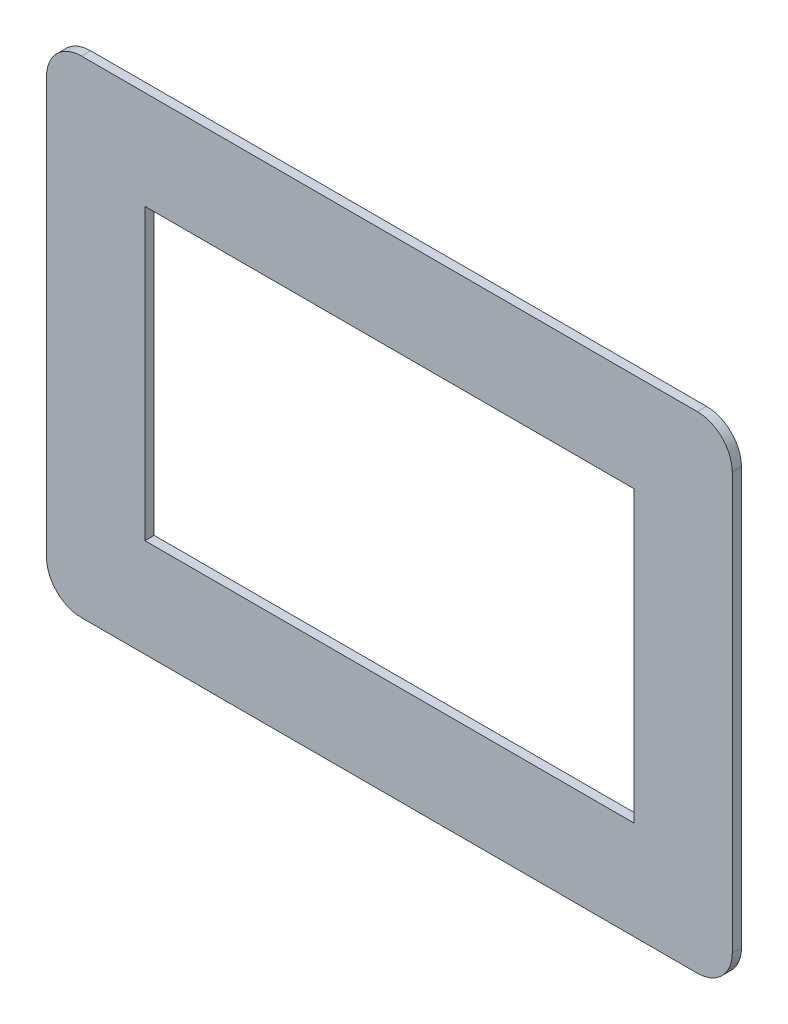
ISO-10303-21;
HEADER;
FILE_DESCRIPTION(('STEP AP214'),'2;1');
FILE_NAME('part.step','',(''),(''),'','','');
FILE_SCHEMA(('AUTOMOTIVE_DESIGN { 1 0 10303 214 1 1 1 1 }'));
ENDSEC;
DATA;
#1=APPLICATION_CONTEXT('core data for automotive mechanical design processes');
#2=APPLICATION_PROTOCOL_DEFINITION('international standard','automotive_design',2000,#1);
#3=PRODUCT_CONTEXT('',#1,'mechanical');
#4=PRODUCT('Part','Part','',(#3));
#5=PRODUCT_RELATED_PRODUCT_CATEGORY('part','',(#4));
#6=PRODUCT_DEFINITION_FORMATION('','',#4);
#7=PRODUCT_DEFINITION_CONTEXT('part definition',#1,'design');
#8=PRODUCT_DEFINITION('design','',#6,#7);
#9=PRODUCT_DEFINITION_SHAPE('','',#8);
#10=(LENGTH_UNIT() NAMED_UNIT(*) SI_UNIT(.MILLI.,.METRE.));
#11=(NAMED_UNIT(*) PLANE_ANGLE_UNIT() SI_UNIT($,.RADIAN.));
#12=(NAMED_UNIT(*) SI_UNIT($,.STERADIAN.) SOLID_ANGLE_UNIT());
#13=UNCERTAINTY_MEASURE_WITH_UNIT(LENGTH_MEASURE(1.E-05),#10,'distance_accuracy_value','');
#14=(GEOMETRIC_REPRESENTATION_CONTEXT(3) GLOBAL_UNCERTAINTY_ASSIGNED_CONTEXT((#13)) GLOBAL_UNIT_ASSIGNED_CONTEXT((#10,
#11,#12)) REPRESENTATION_CONTEXT('',''));
#15=CARTESIAN_POINT('',(0.,0.,0.));
#16=DIRECTION('',(0.,0.,1.));
#17=DIRECTION('',(1.,0.,0.));
#18=AXIS2_PLACEMENT_3D('',#15,#16,#17);
#19=CARTESIAN_POINT('',(99.87625,65.6,0.));
#20=DIRECTION('',(0.,0.,-1.));
#21=DIRECTION('',(-1.,0.,0.));
#22=AXIS2_PLACEMENT_3D('',#19,#20,#21);
#23=PLANE('',#22);
#24=CARTESIAN_POINT('',(99.87625,65.6,0.));
#25=DIRECTION('',(0.,0.,1.));
#26=DIRECTION('',(-1.,0.,0.));
#27=AXIS2_PLACEMENT_3D('',#24,#25,#26);
#28=CIRCLE('',#27,11.);
#29=CARTESIAN_POINT('',(110.87625,65.6,0.));
#30=VERTEX_POINT('',#29);
#31=CARTESIAN_POINT('',(99.87625,76.6,0.));
#32=VERTEX_POINT('',#31);
#33=EDGE_CURVE('E374',#30,#32,#28,.T.);
#34=ORIENTED_EDGE('',*,*,#33,.F.);
#35=DIRECTION('',(0.,1.,0.));
#36=VECTOR('',#35,1.);
#37=CARTESIAN_POINT('',(110.87625,65.6,0.));
#38=LINE('',#37,#36);
#39=CARTESIAN_POINT('',(110.87625,-65.6,0.));
#40=VERTEX_POINT('',#39);
#41=EDGE_CURVE('E379',#40,#30,#38,.T.);
#42=ORIENTED_EDGE('',*,*,#41,.F.);
#43=CARTESIAN_POINT('',(99.87625,-65.6,0.));
#44=DIRECTION('',(0.,0.,1.));
#45=DIRECTION('',(-1.,0.,0.));
#46=AXIS2_PLACEMENT_3D('',#43,#44,#45);
#47=CIRCLE('',#46,11.);
#48=CARTESIAN_POINT('',(99.87625,-76.6,0.));
#49=VERTEX_POINT('',#48);
#50=EDGE_CURVE('E406',#49,#40,#47,.T.);
#51=ORIENTED_EDGE('',*,*,#50,.F.);
#52=DIRECTION('',(1.,0.,0.));
#53=VECTOR('',#52,1.);
#54=CARTESIAN_POINT('',(99.87625,-76.6,0.));
#55=LINE('',#54,#53);
#56=CARTESIAN_POINT('',(-94.12375,-76.6000000000001,0.));
#57=VERTEX_POINT('',#56);
#58=EDGE_CURVE('E404',#57,#49,#55,.T.);
#59=ORIENTED_EDGE('',*,*,#58,.F.);
#60=CARTESIAN_POINT('',(-94.12375,-65.6000000000001,0.));
#61=DIRECTION('',(0.,0.,1.));
#62=DIRECTION('',(-1.,0.,0.));
#63=AXIS2_PLACEMENT_3D('',#60,#61,#62);
#64=CIRCLE('',#63,11.);
#65=CARTESIAN_POINT('',(-105.12375,-65.6000000000001,0.));
#66=VERTEX_POINT('',#65);
#67=EDGE_CURVE('E402',#66,#57,#64,.T.);
#68=ORIENTED_EDGE('',*,*,#67,.F.);
#69=DIRECTION('',(0.,-1.,0.));
#70=VECTOR('',#69,1.);
#71=CARTESIAN_POINT('',(-105.12375,65.6000000000001,0.));
#72=LINE('',#71,#70);
#73=CARTESIAN_POINT('',(-105.12375,65.6000000000001,0.));
#74=VERTEX_POINT('',#73);
#75=EDGE_CURVE('E400',#74,#66,#72,.T.);
#76=ORIENTED_EDGE('',*,*,#75,.F.);
#77=CARTESIAN_POINT('',(-94.12375,65.6000000000001,0.));
#78=DIRECTION('',(0.,0.,1.));
#79=DIRECTION('',(1.,0.,0.));
#80=AXIS2_PLACEMENT_3D('',#77,#78,#79);
#81=CIRCLE('',#80,11.);
#82=CARTESIAN_POINT('',(-94.12375,76.6,0.));
#83=VERTEX_POINT('',#82);
#84=EDGE_CURVE('E398',#83,#74,#81,.T.);
#85=ORIENTED_EDGE('',*,*,#84,.F.);
#86=DIRECTION('',(-1.,0.,0.));
#87=VECTOR('',#86,1.);
#88=CARTESIAN_POINT('',(99.87625,76.6,0.));
#89=LINE('',#88,#87);
#90=EDGE_CURVE('E396',#32,#83,#89,.T.);
#91=ORIENTED_EDGE('',*,*,#90,.F.);
#92=EDGE_LOOP('',(#34,#42,#51,#59,#68,#76,#85,#91));
#93=FACE_BOUND('',#92,.T.);
#94=DIRECTION('',(0.,1.,0.));
#95=VECTOR('',#94,1.);
#96=CARTESIAN_POINT('',(109.87625,-65.6,0.));
#97=LINE('',#96,#95);
#98=CARTESIAN_POINT('',(109.87625,-65.6,0.));
#99=VERTEX_POINT('',#98);
#100=CARTESIAN_POINT('',(109.87625,65.6,0.));
#101=VERTEX_POINT('',#100);
#102=EDGE_CURVE('E292',#99,#101,#97,.T.);
#103=ORIENTED_EDGE('',*,*,#102,.T.);
#104=CARTESIAN_POINT('',(99.87625,65.6,0.));
#105=DIRECTION('',(0.,0.,1.));
#106=DIRECTION('',(1.,0.,0.));
#107=AXIS2_PLACEMENT_3D('',#104,#105,#106);
#108=CIRCLE('',#107,9.99999999999999);
#109=CARTESIAN_POINT('',(99.87625,75.6,0.));
#110=VERTEX_POINT('',#109);
#111=EDGE_CURVE('E48',#101,#110,#108,.T.);
#112=ORIENTED_EDGE('',*,*,#111,.T.);
#113=DIRECTION('',(-1.,0.,0.));
#114=VECTOR('',#113,1.);
#115=CARTESIAN_POINT('',(99.87625,75.6,0.));
#116=LINE('',#115,#114);
#117=CARTESIAN_POINT('',(-94.12375,75.6,0.));
#118=VERTEX_POINT('',#117);
#119=EDGE_CURVE('E308',#110,#118,#116,.T.);
#120=ORIENTED_EDGE('',*,*,#119,.T.);
#121=CARTESIAN_POINT('',(-94.12375,65.6000000000001,0.));
#122=DIRECTION('',(0.,0.,1.));
#123=DIRECTION('',(1.,0.,0.));
#124=AXIS2_PLACEMENT_3D('',#121,#122,#123);
#125=CIRCLE('',#124,9.99999999999995);
#126=CARTESIAN_POINT('',(-104.12375,65.6000000000001,0.));
#127=VERTEX_POINT('',#126);
#128=EDGE_CURVE('E311',#118,#127,#125,.T.);
#129=ORIENTED_EDGE('',*,*,#128,.T.);
#130=DIRECTION('',(0.,-1.,0.));
#131=VECTOR('',#130,1.);
#132=CARTESIAN_POINT('',(-104.12375,65.6000000000001,0.));
#133=LINE('',#132,#131);
#134=CARTESIAN_POINT('',(-104.12375,-65.6000000000001,0.));
#135=VERTEX_POINT('',#134);
#136=EDGE_CURVE('E314',#127,#135,#133,.T.);
#137=ORIENTED_EDGE('',*,*,#136,.T.);
#138=CARTESIAN_POINT('',(-94.12375,-65.6000000000001,0.));
#139=DIRECTION('',(0.,0.,1.));
#140=DIRECTION('',(1.,0.,0.));
#141=AXIS2_PLACEMENT_3D('',#138,#139,#140);
#142=CIRCLE('',#141,10.);
#143=CARTESIAN_POINT('',(-94.12375,-75.6000000000001,0.));
#144=VERTEX_POINT('',#143);
#145=EDGE_CURVE('E317',#135,#144,#142,.T.);
#146=ORIENTED_EDGE('',*,*,#145,.T.);
#147=DIRECTION('',(1.,0.,0.));
#148=VECTOR('',#147,1.);
#149=CARTESIAN_POINT('',(-94.12375,-75.6000000000001,0.));
#150=LINE('',#149,#148);
#151=CARTESIAN_POINT('',(99.87625,-75.6,0.));
#152=VERTEX_POINT('',#151);
#153=EDGE_CURVE('E320',#144,#152,#150,.T.);
#154=ORIENTED_EDGE('',*,*,#153,.T.);
#155=CARTESIAN_POINT('',(99.87625,-65.6,0.));
#156=DIRECTION('',(0.,0.,1.));
#157=DIRECTION('',(1.,0.,0.));
#158=AXIS2_PLACEMENT_3D('',#155,#156,#157);
#159=CIRCLE('',#158,9.99999999999999);
#160=EDGE_CURVE('E323',#152,#99,#159,.T.);
#161=ORIENTED_EDGE('',*,*,#160,.T.);
#162=EDGE_LOOP('',(#103,#112,#120,#129,#137,#146,#154,#161));
#163=FACE_BOUND('',#162,.T.);
#164=ADVANCED_FACE('F33',(#93,#163),#23,.T.);
#165=CARTESIAN_POINT('',(99.87625,65.6,2.9));
#166=DIRECTION('',(0.,0.,-1.));
#167=DIRECTION('',(-1.,0.,0.));
#168=AXIS2_PLACEMENT_3D('',#165,#166,#167);
#169=PLANE('',#168);
#170=CARTESIAN_POINT('',(99.87625,65.6,2.9));
#171=DIRECTION('',(0.,0.,1.));
#172=DIRECTION('',(-1.,0.,0.));
#173=AXIS2_PLACEMENT_3D('',#170,#171,#172);
#174=CIRCLE('',#173,11.);
#175=CARTESIAN_POINT('',(110.87625,65.6,2.9));
#176=VERTEX_POINT('',#175);
#177=CARTESIAN_POINT('',(99.87625,76.6,2.9));
#178=VERTEX_POINT('',#177);
#179=EDGE_CURVE('E375',#176,#178,#174,.T.);
#180=ORIENTED_EDGE('',*,*,#179,.T.);
#181=DIRECTION('',(-1.,0.,0.));
#182=VECTOR('',#181,1.);
#183=CARTESIAN_POINT('',(99.87625,76.6,2.9));
#184=LINE('',#183,#182);
#185=CARTESIAN_POINT('',(-94.12375,76.6,2.9));
#186=VERTEX_POINT('',#185);
#187=EDGE_CURVE('E378',#178,#186,#184,.T.);
#188=ORIENTED_EDGE('',*,*,#187,.T.);
#189=CARTESIAN_POINT('',(-94.12375,65.6000000000001,2.9));
#190=DIRECTION('',(0.,0.,1.));
#191=DIRECTION('',(1.,0.,0.));
#192=AXIS2_PLACEMENT_3D('',#189,#190,#191);
#193=CIRCLE('',#192,11.);
#194=CARTESIAN_POINT('',(-105.12375,65.6000000000001,2.9));
#195=VERTEX_POINT('',#194);
#196=EDGE_CURVE('E381',#186,#195,#193,.T.);
#197=ORIENTED_EDGE('',*,*,#196,.T.);
#198=DIRECTION('',(0.,-1.,0.));
#199=VECTOR('',#198,1.);
#200=CARTESIAN_POINT('',(-105.12375,65.6000000000001,2.9));
#201=LINE('',#200,#199);
#202=CARTESIAN_POINT('',(-105.12375,-65.6000000000001,2.9));
#203=VERTEX_POINT('',#202);
#204=EDGE_CURVE('E383',#195,#203,#201,.T.);
#205=ORIENTED_EDGE('',*,*,#204,.T.);
#206=CARTESIAN_POINT('',(-94.12375,-65.6000000000001,2.9));
#207=DIRECTION('',(0.,0.,1.));
#208=DIRECTION('',(-1.,0.,0.));
#209=AXIS2_PLACEMENT_3D('',#206,#207,#208);
#210=CIRCLE('',#209,11.);
#211=CARTESIAN_POINT('',(-94.12375,-76.6000000000001,2.9));
#212=VERTEX_POINT('',#211);
#213=EDGE_CURVE('E385',#203,#212,#210,.T.);
#214=ORIENTED_EDGE('',*,*,#213,.T.);
#215=DIRECTION('',(1.,0.,0.));
#216=VECTOR('',#215,1.);
#217=CARTESIAN_POINT('',(99.87625,-76.6,2.9));
#218=LINE('',#217,#216);
#219=CARTESIAN_POINT('',(99.87625,-76.6,2.9));
#220=VERTEX_POINT('',#219);
#221=EDGE_CURVE('E387',#212,#220,#218,.T.);
#222=ORIENTED_EDGE('',*,*,#221,.T.);
#223=CARTESIAN_POINT('',(99.87625,-65.6,2.9));
#224=DIRECTION('',(0.,0.,1.));
#225=DIRECTION('',(-1.,0.,0.));
#226=AXIS2_PLACEMENT_3D('',#223,#224,#225);
#227=CIRCLE('',#226,11.);
#228=CARTESIAN_POINT('',(110.87625,-65.6,2.9));
#229=VERTEX_POINT('',#228);
#230=EDGE_CURVE('E389',#220,#229,#227,.T.);
#231=ORIENTED_EDGE('',*,*,#230,.T.);
#232=DIRECTION('',(0.,1.,0.));
#233=VECTOR('',#232,1.);
#234=CARTESIAN_POINT('',(110.87625,65.6,2.9));
#235=LINE('',#234,#233);
#236=EDGE_CURVE('E391',#229,#176,#235,.T.);
#237=ORIENTED_EDGE('',*,*,#236,.T.);
#238=EDGE_LOOP('',(#180,#188,#197,#205,#214,#222,#231,#237));
#239=FACE_BOUND('',#238,.T.);
#240=DIRECTION('',(0.,1.,0.));
#241=VECTOR('',#240,1.);
#242=CARTESIAN_POINT('',(79.87625,45.6,2.9));
#243=LINE('',#242,#241);
#244=CARTESIAN_POINT('',(79.87625,-45.6,2.9));
#245=VERTEX_POINT('',#244);
#246=CARTESIAN_POINT('',(79.87625,45.6,2.9));
#247=VERTEX_POINT('',#246);
#248=EDGE_CURVE('E344',#245,#247,#243,.T.);
#249=ORIENTED_EDGE('',*,*,#248,.F.);
#250=DIRECTION('',(1.,0.,0.));
#251=VECTOR('',#250,1.);
#252=CARTESIAN_POINT('',(79.87625,-45.6,2.9));
#253=LINE('',#252,#251);
#254=CARTESIAN_POINT('',(-74.12375,-45.6,2.9));
#255=VERTEX_POINT('',#254);
#256=EDGE_CURVE('E352',#255,#245,#253,.T.);
#257=ORIENTED_EDGE('',*,*,#256,.F.);
#258=DIRECTION('',(0.,-1.,0.));
#259=VECTOR('',#258,1.);
#260=CARTESIAN_POINT('',(-74.12375,45.6,2.9));
#261=LINE('',#260,#259);
#262=CARTESIAN_POINT('',(-74.12375,45.6,2.9));
#263=VERTEX_POINT('',#262);
#264=EDGE_CURVE('E349',#263,#255,#261,.T.);
#265=ORIENTED_EDGE('',*,*,#264,.F.);
#266=DIRECTION('',(-1.,0.,0.));
#267=VECTOR('',#266,1.);
#268=CARTESIAN_POINT('',(79.87625,45.6,2.9));
#269=LINE('',#268,#267);
#270=EDGE_CURVE('E346',#247,#263,#269,.T.);
#271=ORIENTED_EDGE('',*,*,#270,.F.);
#272=EDGE_LOOP('',(#249,#257,#265,#271));
#273=FACE_BOUND('',#272,.T.);
#274=ADVANCED_FACE('F449',(#239,#273),#169,.F.);
#275=CARTESIAN_POINT('',(99.87625,65.6,0.));
#276=DIRECTION('',(0.,0.,1.));
#277=DIRECTION('',(1.,0.,0.));
#278=AXIS2_PLACEMENT_3D('',#275,#276,#277);
#279=CIRCLE('',#278,7.99999999999999);
#280=CARTESIAN_POINT('',(107.87625,65.6,0.));
#281=VERTEX_POINT('',#280);
#282=CARTESIAN_POINT('',(99.87625,73.6,0.));
#283=VERTEX_POINT('',#282);
#284=EDGE_CURVE('E236',#281,#283,#279,.T.);
#285=ORIENTED_EDGE('',*,*,#284,.F.);
#286=DIRECTION('',(0.,1.,0.));
#287=VECTOR('',#286,1.);
#288=CARTESIAN_POINT('',(107.87625,-65.6,0.));
#289=LINE('',#288,#287);
#290=CARTESIAN_POINT('',(107.87625,-65.6,0.));
#291=VERTEX_POINT('',#290);
#292=EDGE_CURVE('E230',#291,#281,#289,.T.);
#293=ORIENTED_EDGE('',*,*,#292,.F.);
#294=CARTESIAN_POINT('',(99.87625,-65.6,0.));
#295=DIRECTION('',(0.,0.,1.));
#296=DIRECTION('',(1.,0.,0.));
#297=AXIS2_PLACEMENT_3D('',#294,#295,#296);
#298=CIRCLE('',#297,7.99999999999999);
#299=CARTESIAN_POINT('',(99.87625,-73.6,0.));
#300=VERTEX_POINT('',#299);
#301=EDGE_CURVE('E56',#300,#291,#298,.T.);
#302=ORIENTED_EDGE('',*,*,#301,.F.);
#303=DIRECTION('',(1.,0.,0.));
#304=VECTOR('',#303,1.);
#305=CARTESIAN_POINT('',(-94.12375,-73.6000000000001,0.));
#306=LINE('',#305,#304);
#307=CARTESIAN_POINT('',(-94.12375,-73.6000000000001,0.));
#308=VERTEX_POINT('',#307);
#309=EDGE_CURVE('E270',#308,#300,#306,.T.);
#310=ORIENTED_EDGE('',*,*,#309,.F.);
#311=CARTESIAN_POINT('',(-94.12375,-65.6000000000001,0.));
#312=DIRECTION('',(0.,0.,1.));
#313=DIRECTION('',(1.,0.,0.));
#314=AXIS2_PLACEMENT_3D('',#311,#312,#313);
#315=CIRCLE('',#314,8.);
#316=CARTESIAN_POINT('',(-102.12375,-65.6000000000001,0.));
#317=VERTEX_POINT('',#316);
#318=EDGE_CURVE('E267',#317,#308,#315,.T.);
#319=ORIENTED_EDGE('',*,*,#318,.F.);
#320=DIRECTION('',(0.,-1.,0.));
#321=VECTOR('',#320,1.);
#322=CARTESIAN_POINT('',(-102.12375,65.6000000000001,0.));
#323=LINE('',#322,#321);
#324=CARTESIAN_POINT('',(-102.12375,65.6000000000001,0.));
#325=VERTEX_POINT('',#324);
#326=EDGE_CURVE('E264',#325,#317,#323,.T.);
#327=ORIENTED_EDGE('',*,*,#326,.F.);
#328=CARTESIAN_POINT('',(-94.12375,65.6000000000001,0.));
#329=DIRECTION('',(0.,0.,1.));
#330=DIRECTION('',(1.,0.,0.));
#331=AXIS2_PLACEMENT_3D('',#328,#329,#330);
#332=CIRCLE('',#331,7.99999999999994);
#333=CARTESIAN_POINT('',(-94.12375,73.6,0.));
#334=VERTEX_POINT('',#333);
#335=EDGE_CURVE('E261',#334,#325,#332,.T.);
#336=ORIENTED_EDGE('',*,*,#335,.F.);
#337=DIRECTION('',(-1.,0.,0.));
#338=VECTOR('',#337,1.);
#339=CARTESIAN_POINT('',(99.87625,73.6,0.));
#340=LINE('',#339,#338);
#341=EDGE_CURVE('E259',#283,#334,#340,.T.);
#342=ORIENTED_EDGE('',*,*,#341,.F.);
#343=EDGE_LOOP('',(#285,#293,#302,#310,#319,#327,#336,#342));
#344=FACE_BOUND('',#343,.T.);
#345=DIRECTION('',(1.,0.,0.));
#346=VECTOR('',#345,1.);
#347=CARTESIAN_POINT('',(79.87625,-45.6,0.));
#348=LINE('',#347,#346);
#349=CARTESIAN_POINT('',(-74.12375,-45.6,0.));
#350=VERTEX_POINT('',#349);
#351=CARTESIAN_POINT('',(79.87625,-45.6,0.));
#352=VERTEX_POINT('',#351);
#353=EDGE_CURVE('E347',#350,#352,#348,.T.);
#354=ORIENTED_EDGE('',*,*,#353,.T.);
#355=DIRECTION('',(0.,1.,0.));
#356=VECTOR('',#355,1.);
#357=CARTESIAN_POINT('',(79.87625,45.6,0.));
#358=LINE('',#357,#356);
#359=CARTESIAN_POINT('',(79.87625,45.6,0.));
#360=VERTEX_POINT('',#359);
#361=EDGE_CURVE('E343',#352,#360,#358,.T.);
#362=ORIENTED_EDGE('',*,*,#361,.T.);
#363=DIRECTION('',(-1.,0.,0.));
#364=VECTOR('',#363,1.);
#365=CARTESIAN_POINT('',(79.87625,45.6,0.));
#366=LINE('',#365,#364);
#367=CARTESIAN_POINT('',(-74.12375,45.6,0.));
#368=VERTEX_POINT('',#367);
#369=EDGE_CURVE('E357',#360,#368,#366,.T.);
#370=ORIENTED_EDGE('',*,*,#369,.T.);
#371=DIRECTION('',(0.,-1.,0.));
#372=VECTOR('',#371,1.);
#373=CARTESIAN_POINT('',(-74.12375,45.6,0.));
#374=LINE('',#373,#372);
#375=EDGE_CURVE('E360',#368,#350,#374,.T.);
#376=ORIENTED_EDGE('',*,*,#375,.T.);
#377=EDGE_LOOP('',(#354,#362,#370,#376));
#378=FACE_BOUND('',#377,.T.);
#379=ADVANCED_FACE('F478',(#344,#378),#23,.T.);
#380=CARTESIAN_POINT('',(99.87625,65.6,2.9));
#381=DIRECTION('',(0.,0.,-1.));
#382=DIRECTION('',(-1.,0.,0.));
#383=AXIS2_PLACEMENT_3D('',#380,#381,#382);
#384=CYLINDRICAL_SURFACE('',#383,11.);
#385=ORIENTED_EDGE('',*,*,#33,.T.);
#386=DIRECTION('',(0.,0.,-1.));
#387=VECTOR('',#386,1.);
#388=CARTESIAN_POINT('',(99.87625,76.6,2.9));
#389=LINE('',#388,#387);
#390=EDGE_CURVE('E11',#178,#32,#389,.T.);
#391=ORIENTED_EDGE('',*,*,#390,.F.);
#392=ORIENTED_EDGE('',*,*,#179,.F.);
#393=DIRECTION('',(0.,0.,-1.));
#394=VECTOR('',#393,1.);
#395=CARTESIAN_POINT('',(110.87625,65.6,2.9));
#396=LINE('',#395,#394);
#397=EDGE_CURVE('E393',#176,#30,#396,.T.);
#398=ORIENTED_EDGE('',*,*,#397,.T.);
#399=EDGE_LOOP('',(#385,#391,#392,#398));
#400=FACE_BOUND('',#399,.T.);
#401=ADVANCED_FACE('F35',(#400),#384,.T.);
#402=CARTESIAN_POINT('',(99.87625,76.6,2.9));
#403=DIRECTION('',(0.,-1.,0.));
#404=DIRECTION('',(1.,0.,0.));
#405=AXIS2_PLACEMENT_3D('',#402,#403,#404);
#406=PLANE('',#405);
#407=ORIENTED_EDGE('',*,*,#90,.T.);
#408=DIRECTION('',(0.,0.,-1.));
#409=VECTOR('',#408,1.);
#410=CARTESIAN_POINT('',(-94.12375,76.6,2.9));
#411=LINE('',#410,#409);
#412=EDGE_CURVE('E41',#186,#83,#411,.T.);
#413=ORIENTED_EDGE('',*,*,#412,.F.);
#414=ORIENTED_EDGE('',*,*,#187,.F.);
#415=ORIENTED_EDGE('',*,*,#390,.T.);
#416=EDGE_LOOP('',(#407,#413,#414,#415));
#417=FACE_BOUND('',#416,.T.);
#418=ADVANCED_FACE('F454',(#417),#406,.F.);
#419=CARTESIAN_POINT('',(-94.12375,65.6000000000001,2.9));
#420=DIRECTION('',(0.,0.,-1.));
#421=DIRECTION('',(-1.,0.,0.));
#422=AXIS2_PLACEMENT_3D('',#419,#420,#421);
#423=CYLINDRICAL_SURFACE('',#422,11.);
#424=ORIENTED_EDGE('',*,*,#84,.T.);
#425=DIRECTION('',(0.,0.,-1.));
#426=VECTOR('',#425,1.);
#427=CARTESIAN_POINT('',(-105.12375,65.6000000000001,2.9));
#428=LINE('',#427,#426);
#429=EDGE_CURVE('E423',#195,#74,#428,.T.);
#430=ORIENTED_EDGE('',*,*,#429,.F.);
#431=ORIENTED_EDGE('',*,*,#196,.F.);
#432=ORIENTED_EDGE('',*,*,#412,.T.);
#433=EDGE_LOOP('',(#424,#430,#431,#432));
#434=FACE_BOUND('',#433,.T.);
#435=ADVANCED_FACE('F430',(#434),#423,.T.);
#436=CARTESIAN_POINT('',(-105.12375,65.6000000000001,2.9));
#437=DIRECTION('',(1.,0.,0.));
#438=DIRECTION('',(0.,0.,-1.));
#439=AXIS2_PLACEMENT_3D('',#436,#437,#438);
#440=PLANE('',#439);
#441=ORIENTED_EDGE('',*,*,#75,.T.);
#442=DIRECTION('',(0.,0.,-1.));
#443=VECTOR('',#442,1.);
#444=CARTESIAN_POINT('',(-105.12375,-65.6000000000001,2.9));
#445=LINE('',#444,#443);
#446=EDGE_CURVE('E420',#203,#66,#445,.T.);
#447=ORIENTED_EDGE('',*,*,#446,.F.);
#448=ORIENTED_EDGE('',*,*,#204,.F.);
#449=ORIENTED_EDGE('',*,*,#429,.T.);
#450=EDGE_LOOP('',(#441,#447,#448,#449));
#451=FACE_BOUND('',#450,.T.);
#452=ADVANCED_FACE('F441',(#451),#440,.F.);
#453=CARTESIAN_POINT('',(-94.12375,-65.6000000000001,2.9));
#454=DIRECTION('',(0.,0.,-1.));
#455=DIRECTION('',(-1.,0.,0.));
#456=AXIS2_PLACEMENT_3D('',#453,#454,#455);
#457=CYLINDRICAL_SURFACE('',#456,11.);
#458=ORIENTED_EDGE('',*,*,#67,.T.);
#459=DIRECTION('',(0.,0.,-1.));
#460=VECTOR('',#459,1.);
#461=CARTESIAN_POINT('',(-94.12375,-76.6000000000001,2.9));
#462=LINE('',#461,#460);
#463=EDGE_CURVE('E417',#212,#57,#462,.T.);
#464=ORIENTED_EDGE('',*,*,#463,.F.);
#465=ORIENTED_EDGE('',*,*,#213,.F.);
#466=ORIENTED_EDGE('',*,*,#446,.T.);
#467=EDGE_LOOP('',(#458,#464,#465,#466));
#468=FACE_BOUND('',#467,.T.);
#469=ADVANCED_FACE('F445',(#468),#457,.T.);
#470=CARTESIAN_POINT('',(99.87625,-76.6,2.9));
#471=DIRECTION('',(0.,1.,0.));
#472=DIRECTION('',(-1.,0.,0.));
#473=AXIS2_PLACEMENT_3D('',#470,#471,#472);
#474=PLANE('',#473);
#475=ORIENTED_EDGE('',*,*,#58,.T.);
#476=DIRECTION('',(0.,0.,-1.));
#477=VECTOR('',#476,1.);
#478=CARTESIAN_POINT('',(99.87625,-76.6,2.9));
#479=LINE('',#478,#477);
#480=EDGE_CURVE('E414',#220,#49,#479,.T.);
#481=ORIENTED_EDGE('',*,*,#480,.F.);
#482=ORIENTED_EDGE('',*,*,#221,.F.);
#483=ORIENTED_EDGE('',*,*,#463,.T.);
#484=EDGE_LOOP('',(#475,#481,#482,#483));
#485=FACE_BOUND('',#484,.T.);
#486=ADVANCED_FACE('F467',(#485),#474,.F.);
#487=CARTESIAN_POINT('',(99.87625,-65.6,2.9));
#488=DIRECTION('',(0.,0.,-1.));
#489=DIRECTION('',(-1.,0.,0.));
#490=AXIS2_PLACEMENT_3D('',#487,#488,#489);
#491=CYLINDRICAL_SURFACE('',#490,11.);
#492=ORIENTED_EDGE('',*,*,#50,.T.);
#493=DIRECTION('',(0.,0.,-1.));
#494=VECTOR('',#493,1.);
#495=CARTESIAN_POINT('',(110.87625,-65.6,2.9));
#496=LINE('',#495,#494);
#497=EDGE_CURVE('E411',#229,#40,#496,.T.);
#498=ORIENTED_EDGE('',*,*,#497,.F.);
#499=ORIENTED_EDGE('',*,*,#230,.F.);
#500=ORIENTED_EDGE('',*,*,#480,.T.);
#501=EDGE_LOOP('',(#492,#498,#499,#500));
#502=FACE_BOUND('',#501,.T.);
#503=ADVANCED_FACE('F465',(#502),#491,.T.);
#504=CARTESIAN_POINT('',(110.87625,65.6,2.9));
#505=DIRECTION('',(-1.,0.,0.));
#506=DIRECTION('',(0.,-1.,0.));
#507=AXIS2_PLACEMENT_3D('',#504,#505,#506);
#508=PLANE('',#507);
#509=ORIENTED_EDGE('',*,*,#41,.T.);
#510=ORIENTED_EDGE('',*,*,#397,.F.);
#511=ORIENTED_EDGE('',*,*,#236,.F.);
#512=ORIENTED_EDGE('',*,*,#497,.T.);
#513=EDGE_LOOP('',(#509,#510,#511,#512));
#514=FACE_BOUND('',#513,.T.);
#515=ADVANCED_FACE('F460',(#514),#508,.F.);
#516=CARTESIAN_POINT('',(79.87625,45.6,2.9));
#517=DIRECTION('',(-1.,0.,0.));
#518=DIRECTION('',(0.,-1.,0.));
#519=AXIS2_PLACEMENT_3D('',#516,#517,#518);
#520=PLANE('',#519);
#521=ORIENTED_EDGE('',*,*,#361,.F.);
#522=DIRECTION('',(0.,0.,-1.));
#523=VECTOR('',#522,1.);
#524=CARTESIAN_POINT('',(79.87625,-45.6,2.9));
#525=LINE('',#524,#523);
#526=EDGE_CURVE('E354',#245,#352,#525,.T.);
#527=ORIENTED_EDGE('',*,*,#526,.F.);
#528=ORIENTED_EDGE('',*,*,#248,.T.);
#529=DIRECTION('',(0.,0.,-1.));
#530=VECTOR('',#529,1.);
#531=CARTESIAN_POINT('',(79.87625,45.6,2.9));
#532=LINE('',#531,#530);
#533=EDGE_CURVE('E371',#247,#360,#532,.T.);
#534=ORIENTED_EDGE('',*,*,#533,.T.);
#535=EDGE_LOOP('',(#521,#527,#528,#534));
#536=FACE_BOUND('',#535,.T.);
#537=ADVANCED_FACE('F499',(#536),#520,.T.);
#538=CARTESIAN_POINT('',(79.87625,45.6,2.9));
#539=DIRECTION('',(0.,-1.,0.));
#540=DIRECTION('',(1.,0.,0.));
#541=AXIS2_PLACEMENT_3D('',#538,#539,#540);
#542=PLANE('',#541);
#543=ORIENTED_EDGE('',*,*,#369,.F.);
#544=ORIENTED_EDGE('',*,*,#533,.F.);
#545=ORIENTED_EDGE('',*,*,#270,.T.);
#546=DIRECTION('',(0.,0.,-1.));
#547=VECTOR('',#546,1.);
#548=CARTESIAN_POINT('',(-74.12375,45.6,2.9));
#549=LINE('',#548,#547);
#550=EDGE_CURVE('E369',#263,#368,#549,.T.);
#551=ORIENTED_EDGE('',*,*,#550,.T.);
#552=EDGE_LOOP('',(#543,#544,#545,#551));
#553=FACE_BOUND('',#552,.T.);
#554=ADVANCED_FACE('F505',(#553),#542,.T.);
#555=CARTESIAN_POINT('',(-74.12375,45.6,2.9));
#556=DIRECTION('',(1.,0.,0.));
#557=DIRECTION('',(0.,0.,-1.));
#558=AXIS2_PLACEMENT_3D('',#555,#556,#557);
#559=PLANE('',#558);
#560=ORIENTED_EDGE('',*,*,#375,.F.);
#561=ORIENTED_EDGE('',*,*,#550,.F.);
#562=ORIENTED_EDGE('',*,*,#264,.T.);
#563=DIRECTION('',(0.,0.,-1.));
#564=VECTOR('',#563,1.);
#565=CARTESIAN_POINT('',(-74.12375,-45.6,2.9));
#566=LINE('',#565,#564);
#567=EDGE_CURVE('E367',#255,#350,#566,.T.);
#568=ORIENTED_EDGE('',*,*,#567,.T.);
#569=EDGE_LOOP('',(#560,#561,#562,#568));
#570=FACE_BOUND('',#569,.T.);
#571=ADVANCED_FACE('F507',(#570),#559,.T.);
#572=CARTESIAN_POINT('',(79.87625,-45.6,2.9));
#573=DIRECTION('',(0.,1.,0.));
#574=DIRECTION('',(-1.,0.,0.));
#575=AXIS2_PLACEMENT_3D('',#572,#573,#574);
#576=PLANE('',#575);
#577=ORIENTED_EDGE('',*,*,#353,.F.);
#578=ORIENTED_EDGE('',*,*,#567,.F.);
#579=ORIENTED_EDGE('',*,*,#256,.T.);
#580=ORIENTED_EDGE('',*,*,#526,.T.);
#581=EDGE_LOOP('',(#577,#578,#579,#580));
#582=FACE_BOUND('',#581,.T.);
#583=ADVANCED_FACE('F494',(#582),#576,.T.);
#584=CARTESIAN_POINT('',(99.87625,65.6,1.5));
#585=DIRECTION('',(0.,0.,1.));
#586=DIRECTION('',(1.,0.,0.));
#587=AXIS2_PLACEMENT_3D('',#584,#585,#586);
#588=PLANE('',#587);
#589=CARTESIAN_POINT('',(99.87625,65.6,1.5));
#590=DIRECTION('',(0.,0.,1.));
#591=DIRECTION('',(1.,0.,0.));
#592=AXIS2_PLACEMENT_3D('',#589,#590,#591);
#593=CIRCLE('',#592,9.99999999999999);
#594=CARTESIAN_POINT('',(109.87625,65.6,1.5));
#595=VERTEX_POINT('',#594);
#596=CARTESIAN_POINT('',(99.87625,75.6,1.5));
#597=VERTEX_POINT('',#596);
#598=EDGE_CURVE('E288',#595,#597,#593,.T.);
#599=ORIENTED_EDGE('',*,*,#598,.F.);
#600=DIRECTION('',(0.,1.,0.));
#601=VECTOR('',#600,1.);
#602=CARTESIAN_POINT('',(109.87625,-65.6,1.5));
#603=LINE('',#602,#601);
#604=CARTESIAN_POINT('',(109.87625,-65.6,1.5));
#605=VERTEX_POINT('',#604);
#606=EDGE_CURVE('E304',#605,#595,#603,.T.);
#607=ORIENTED_EDGE('',*,*,#606,.F.);
#608=CARTESIAN_POINT('',(99.87625,-65.6,1.5));
#609=DIRECTION('',(0.,0.,1.));
#610=DIRECTION('',(1.,0.,0.));
#611=AXIS2_PLACEMENT_3D('',#608,#609,#610);
#612=CIRCLE('',#611,9.99999999999999);
#613=CARTESIAN_POINT('',(99.87625,-75.6,1.5));
#614=VERTEX_POINT('',#613);
#615=EDGE_CURVE('E302',#614,#605,#612,.T.);
#616=ORIENTED_EDGE('',*,*,#615,.F.);
#617=DIRECTION('',(1.,0.,0.));
#618=VECTOR('',#617,1.);
#619=CARTESIAN_POINT('',(-94.12375,-75.6000000000001,1.5));
#620=LINE('',#619,#618);
#621=CARTESIAN_POINT('',(-94.12375,-75.6000000000001,1.5));
#622=VERTEX_POINT('',#621);
#623=EDGE_CURVE('E300',#622,#614,#620,.T.);
#624=ORIENTED_EDGE('',*,*,#623,.F.);
#625=CARTESIAN_POINT('',(-94.12375,-65.6000000000001,1.5));
#626=DIRECTION('',(0.,0.,1.));
#627=DIRECTION('',(1.,0.,0.));
#628=AXIS2_PLACEMENT_3D('',#625,#626,#627);
#629=CIRCLE('',#628,10.);
#630=CARTESIAN_POINT('',(-104.12375,-65.6000000000001,1.5));
#631=VERTEX_POINT('',#630);
#632=EDGE_CURVE('E298',#631,#622,#629,.T.);
#633=ORIENTED_EDGE('',*,*,#632,.F.);
#634=DIRECTION('',(0.,-1.,0.));
#635=VECTOR('',#634,1.);
#636=CARTESIAN_POINT('',(-104.12375,65.6000000000001,1.5));
#637=LINE('',#636,#635);
#638=CARTESIAN_POINT('',(-104.12375,65.6000000000001,1.5));
#639=VERTEX_POINT('',#638);
#640=EDGE_CURVE('E296',#639,#631,#637,.T.);
#641=ORIENTED_EDGE('',*,*,#640,.F.);
#642=CARTESIAN_POINT('',(-94.12375,65.6000000000001,1.5));
#643=DIRECTION('',(0.,0.,1.));
#644=DIRECTION('',(1.,0.,0.));
#645=AXIS2_PLACEMENT_3D('',#642,#643,#644);
#646=CIRCLE('',#645,9.99999999999995);
#647=CARTESIAN_POINT('',(-94.12375,75.6,1.5));
#648=VERTEX_POINT('',#647);
#649=EDGE_CURVE('E294',#648,#639,#646,.T.);
#650=ORIENTED_EDGE('',*,*,#649,.F.);
#651=DIRECTION('',(-1.,0.,0.));
#652=VECTOR('',#651,1.);
#653=CARTESIAN_POINT('',(99.87625,75.6,1.5));
#654=LINE('',#653,#652);
#655=EDGE_CURVE('E291',#597,#648,#654,.T.);
#656=ORIENTED_EDGE('',*,*,#655,.F.);
#657=EDGE_LOOP('',(#599,#607,#616,#624,#633,#641,#650,#656));
#658=FACE_BOUND('',#657,.T.);
#659=DIRECTION('',(-1.,0.,0.));
#660=VECTOR('',#659,1.);
#661=CARTESIAN_POINT('',(99.87625,73.6,1.5));
#662=LINE('',#661,#660);
#663=CARTESIAN_POINT('',(99.87625,73.6,1.5));
#664=VERTEX_POINT('',#663);
#665=CARTESIAN_POINT('',(-94.12375,73.6,1.5));
#666=VERTEX_POINT('',#665);
#667=EDGE_CURVE('E223',#664,#666,#662,.T.);
#668=ORIENTED_EDGE('',*,*,#667,.T.);
#669=CARTESIAN_POINT('',(-94.12375,65.6000000000001,1.5));
#670=DIRECTION('',(0.,0.,1.));
#671=DIRECTION('',(1.,0.,0.));
#672=AXIS2_PLACEMENT_3D('',#669,#670,#671);
#673=CIRCLE('',#672,7.99999999999994);
#674=CARTESIAN_POINT('',(-102.12375,65.6000000000001,1.5));
#675=VERTEX_POINT('',#674);
#676=EDGE_CURVE('E244',#666,#675,#673,.T.);
#677=ORIENTED_EDGE('',*,*,#676,.T.);
#678=DIRECTION('',(0.,-1.,0.));
#679=VECTOR('',#678,1.);
#680=CARTESIAN_POINT('',(-102.12375,65.6000000000001,1.5));
#681=LINE('',#680,#679);
#682=CARTESIAN_POINT('',(-102.12375,-65.6000000000001,1.5));
#683=VERTEX_POINT('',#682);
#684=EDGE_CURVE('E246',#675,#683,#681,.T.);
#685=ORIENTED_EDGE('',*,*,#684,.T.);
#686=CARTESIAN_POINT('',(-94.12375,-65.6000000000001,1.5));
#687=DIRECTION('',(0.,0.,1.));
#688=DIRECTION('',(1.,0.,0.));
#689=AXIS2_PLACEMENT_3D('',#686,#687,#688);
#690=CIRCLE('',#689,8.);
#691=CARTESIAN_POINT('',(-94.12375,-73.6000000000001,1.5));
#692=VERTEX_POINT('',#691);
#693=EDGE_CURVE('E250',#683,#692,#690,.T.);
#694=ORIENTED_EDGE('',*,*,#693,.T.);
#695=DIRECTION('',(1.,0.,0.));
#696=VECTOR('',#695,1.);
#697=CARTESIAN_POINT('',(-94.12375,-73.6000000000001,1.5));
#698=LINE('',#697,#696);
#699=CARTESIAN_POINT('',(99.87625,-73.6,1.5));
#700=VERTEX_POINT('',#699);
#701=EDGE_CURVE('E252',#692,#700,#698,.T.);
#702=ORIENTED_EDGE('',*,*,#701,.T.);
#703=CARTESIAN_POINT('',(99.87625,-65.6,1.5));
#704=DIRECTION('',(0.,0.,1.));
#705=DIRECTION('',(1.,0.,0.));
#706=AXIS2_PLACEMENT_3D('',#703,#704,#705);
#707=CIRCLE('',#706,7.99999999999999);
#708=CARTESIAN_POINT('',(107.87625,-65.6,1.5));
#709=VERTEX_POINT('',#708);
#710=EDGE_CURVE('E254',#700,#709,#707,.T.);
#711=ORIENTED_EDGE('',*,*,#710,.T.);
#712=DIRECTION('',(0.,1.,0.));
#713=VECTOR('',#712,1.);
#714=CARTESIAN_POINT('',(107.87625,-65.6,1.5));
#715=LINE('',#714,#713);
#716=CARTESIAN_POINT('',(107.87625,65.6,1.5));
#717=VERTEX_POINT('',#716);
#718=EDGE_CURVE('E227',#709,#717,#715,.T.);
#719=ORIENTED_EDGE('',*,*,#718,.T.);
#720=CARTESIAN_POINT('',(99.87625,65.6,1.5));
#721=DIRECTION('',(0.,0.,1.));
#722=DIRECTION('',(1.,0.,0.));
#723=AXIS2_PLACEMENT_3D('',#720,#721,#722);
#724=CIRCLE('',#723,7.99999999999999);
#725=EDGE_CURVE('E219',#717,#664,#724,.T.);
#726=ORIENTED_EDGE('',*,*,#725,.T.);
#727=EDGE_LOOP('',(#668,#677,#685,#694,#702,#711,#719,#726));
#728=FACE_BOUND('',#727,.T.);
#729=ADVANCED_FACE('F221',(#658,#728),#588,.F.);
#730=CARTESIAN_POINT('',(99.87625,65.6,1.5));
#731=DIRECTION('',(0.,0.,-1.));
#732=DIRECTION('',(-1.,0.,0.));
#733=AXIS2_PLACEMENT_3D('',#730,#731,#732);
#734=CYLINDRICAL_SURFACE('',#733,9.99999999999999);
#735=ORIENTED_EDGE('',*,*,#111,.F.);
#736=DIRECTION('',(0.,0.,-1.));
#737=VECTOR('',#736,1.);
#738=CARTESIAN_POINT('',(109.87625,65.6,1.5));
#739=LINE('',#738,#737);
#740=EDGE_CURVE('E306',#595,#101,#739,.T.);
#741=ORIENTED_EDGE('',*,*,#740,.F.);
#742=ORIENTED_EDGE('',*,*,#598,.T.);
#743=DIRECTION('',(0.,0.,-1.));
#744=VECTOR('',#743,1.);
#745=CARTESIAN_POINT('',(99.87625,75.6,1.5));
#746=LINE('',#745,#744);
#747=EDGE_CURVE('E341',#597,#110,#746,.T.);
#748=ORIENTED_EDGE('',*,*,#747,.T.);
#749=EDGE_LOOP('',(#735,#741,#742,#748));
#750=FACE_BOUND('',#749,.T.);
#751=ADVANCED_FACE('F589',(#750),#734,.F.);
#752=CARTESIAN_POINT('',(99.87625,75.6,1.5));
#753=DIRECTION('',(0.,-1.,0.));
#754=DIRECTION('',(1.,0.,0.));
#755=AXIS2_PLACEMENT_3D('',#752,#753,#754);
#756=PLANE('',#755);
#757=ORIENTED_EDGE('',*,*,#119,.F.);
#758=ORIENTED_EDGE('',*,*,#747,.F.);
#759=ORIENTED_EDGE('',*,*,#655,.T.);
#760=DIRECTION('',(0.,0.,-1.));
#761=VECTOR('',#760,1.);
#762=CARTESIAN_POINT('',(-94.12375,75.6,1.5));
#763=LINE('',#762,#761);
#764=EDGE_CURVE('E339',#648,#118,#763,.T.);
#765=ORIENTED_EDGE('',*,*,#764,.T.);
#766=EDGE_LOOP('',(#757,#758,#759,#765));
#767=FACE_BOUND('',#766,.T.);
#768=ADVANCED_FACE('F599',(#767),#756,.T.);
#769=CARTESIAN_POINT('',(-94.12375,65.6000000000001,1.5));
#770=DIRECTION('',(0.,0.,-1.));
#771=DIRECTION('',(-1.,0.,0.));
#772=AXIS2_PLACEMENT_3D('',#769,#770,#771);
#773=CYLINDRICAL_SURFACE('',#772,9.99999999999995);
#774=ORIENTED_EDGE('',*,*,#128,.F.);
#775=ORIENTED_EDGE('',*,*,#764,.F.);
#776=ORIENTED_EDGE('',*,*,#649,.T.);
#777=DIRECTION('',(0.,0.,-1.));
#778=VECTOR('',#777,1.);
#779=CARTESIAN_POINT('',(-104.12375,65.6000000000001,1.5));
#780=LINE('',#779,#778);
#781=EDGE_CURVE('E337',#639,#127,#780,.T.);
#782=ORIENTED_EDGE('',*,*,#781,.T.);
#783=EDGE_LOOP('',(#774,#775,#776,#782));
#784=FACE_BOUND('',#783,.T.);
#785=ADVANCED_FACE('F607',(#784),#773,.F.);
#786=CARTESIAN_POINT('',(-104.12375,65.6000000000001,1.5));
#787=DIRECTION('',(1.,0.,0.));
#788=DIRECTION('',(0.,1.,0.));
#789=AXIS2_PLACEMENT_3D('',#786,#787,#788);
#790=PLANE('',#789);
#791=ORIENTED_EDGE('',*,*,#136,.F.);
#792=ORIENTED_EDGE('',*,*,#781,.F.);
#793=ORIENTED_EDGE('',*,*,#640,.T.);
#794=DIRECTION('',(0.,0.,-1.));
#795=VECTOR('',#794,1.);
#796=CARTESIAN_POINT('',(-104.12375,-65.6000000000001,1.5));
#797=LINE('',#796,#795);
#798=EDGE_CURVE('E335',#631,#135,#797,.T.);
#799=ORIENTED_EDGE('',*,*,#798,.T.);
#800=EDGE_LOOP('',(#791,#792,#793,#799));
#801=FACE_BOUND('',#800,.T.);
#802=ADVANCED_FACE('F617',(#801),#790,.T.);
#803=CARTESIAN_POINT('',(-94.12375,-65.6000000000001,1.5));
#804=DIRECTION('',(0.,0.,-1.));
#805=DIRECTION('',(-1.,0.,0.));
#806=AXIS2_PLACEMENT_3D('',#803,#804,#805);
#807=CYLINDRICAL_SURFACE('',#806,10.);
#808=ORIENTED_EDGE('',*,*,#145,.F.);
#809=ORIENTED_EDGE('',*,*,#798,.F.);
#810=ORIENTED_EDGE('',*,*,#632,.T.);
#811=DIRECTION('',(0.,0.,-1.));
#812=VECTOR('',#811,1.);
#813=CARTESIAN_POINT('',(-94.12375,-75.6000000000001,1.5));
#814=LINE('',#813,#812);
#815=EDGE_CURVE('E333',#622,#144,#814,.T.);
#816=ORIENTED_EDGE('',*,*,#815,.T.);
#817=EDGE_LOOP('',(#808,#809,#810,#816));
#818=FACE_BOUND('',#817,.T.);
#819=ADVANCED_FACE('F627',(#818),#807,.F.);
#820=CARTESIAN_POINT('',(-94.12375,-75.6000000000001,1.5));
#821=DIRECTION('',(0.,1.,0.));
#822=DIRECTION('',(-1.,0.,0.));
#823=AXIS2_PLACEMENT_3D('',#820,#821,#822);
#824=PLANE('',#823);
#825=ORIENTED_EDGE('',*,*,#153,.F.);
#826=ORIENTED_EDGE('',*,*,#815,.F.);
#827=ORIENTED_EDGE('',*,*,#623,.T.);
#828=DIRECTION('',(0.,0.,-1.));
#829=VECTOR('',#828,1.);
#830=CARTESIAN_POINT('',(99.87625,-75.6,1.5));
#831=LINE('',#830,#829);
#832=EDGE_CURVE('E331',#614,#152,#831,.T.);
#833=ORIENTED_EDGE('',*,*,#832,.T.);
#834=EDGE_LOOP('',(#825,#826,#827,#833));
#835=FACE_BOUND('',#834,.T.);
#836=ADVANCED_FACE('F637',(#835),#824,.T.);
#837=CARTESIAN_POINT('',(99.87625,-65.6,1.5));
#838=DIRECTION('',(0.,0.,-1.));
#839=DIRECTION('',(-1.,0.,0.));
#840=AXIS2_PLACEMENT_3D('',#837,#838,#839);
#841=CYLINDRICAL_SURFACE('',#840,9.99999999999999);
#842=ORIENTED_EDGE('',*,*,#160,.F.);
#843=ORIENTED_EDGE('',*,*,#832,.F.);
#844=ORIENTED_EDGE('',*,*,#615,.T.);
#845=DIRECTION('',(0.,0.,-1.));
#846=VECTOR('',#845,1.);
#847=CARTESIAN_POINT('',(109.87625,-65.6,1.5));
#848=LINE('',#847,#846);
#849=EDGE_CURVE('E329',#605,#99,#848,.T.);
#850=ORIENTED_EDGE('',*,*,#849,.T.);
#851=EDGE_LOOP('',(#842,#843,#844,#850));
#852=FACE_BOUND('',#851,.T.);
#853=ADVANCED_FACE('F647',(#852),#841,.F.);
#854=CARTESIAN_POINT('',(109.87625,-65.6,1.5));
#855=DIRECTION('',(-1.,0.,0.));
#856=DIRECTION('',(0.,0.,1.));
#857=AXIS2_PLACEMENT_3D('',#854,#855,#856);
#858=PLANE('',#857);
#859=ORIENTED_EDGE('',*,*,#102,.F.);
#860=ORIENTED_EDGE('',*,*,#849,.F.);
#861=ORIENTED_EDGE('',*,*,#606,.T.);
#862=ORIENTED_EDGE('',*,*,#740,.T.);
#863=EDGE_LOOP('',(#859,#860,#861,#862));
#864=FACE_BOUND('',#863,.T.);
#865=ADVANCED_FACE('F657',(#864),#858,.T.);
#866=CARTESIAN_POINT('',(99.87625,65.6,1.5));
#867=DIRECTION('',(0.,0.,-1.));
#868=DIRECTION('',(-1.,0.,0.));
#869=AXIS2_PLACEMENT_3D('',#866,#867,#868);
#870=CYLINDRICAL_SURFACE('',#869,7.99999999999999);
#871=ORIENTED_EDGE('',*,*,#284,.T.);
#872=DIRECTION('',(0.,0.,-1.));
#873=VECTOR('',#872,1.);
#874=CARTESIAN_POINT('',(99.87625,73.6,1.5));
#875=LINE('',#874,#873);
#876=EDGE_CURVE('E233',#664,#283,#875,.T.);
#877=ORIENTED_EDGE('',*,*,#876,.F.);
#878=ORIENTED_EDGE('',*,*,#725,.F.);
#879=DIRECTION('',(0.,0.,-1.));
#880=VECTOR('',#879,1.);
#881=CARTESIAN_POINT('',(107.87625,65.6,1.5));
#882=LINE('',#881,#880);
#883=EDGE_CURVE('E257',#717,#281,#882,.T.);
#884=ORIENTED_EDGE('',*,*,#883,.T.);
#885=EDGE_LOOP('',(#871,#877,#878,#884));
#886=FACE_BOUND('',#885,.T.);
#887=ADVANCED_FACE('F234',(#886),#870,.T.);
#888=CARTESIAN_POINT('',(99.87625,73.6,1.5));
#889=DIRECTION('',(0.,-1.,0.));
#890=DIRECTION('',(1.,0.,0.));
#891=AXIS2_PLACEMENT_3D('',#888,#889,#890);
#892=PLANE('',#891);
#893=ORIENTED_EDGE('',*,*,#341,.T.);
#894=DIRECTION('',(0.,0.,-1.));
#895=VECTOR('',#894,1.);
#896=CARTESIAN_POINT('',(-94.12375,73.6,1.5));
#897=LINE('',#896,#895);
#898=EDGE_CURVE('E240',#666,#334,#897,.T.);
#899=ORIENTED_EDGE('',*,*,#898,.F.);
#900=ORIENTED_EDGE('',*,*,#667,.F.);
#901=ORIENTED_EDGE('',*,*,#876,.T.);
#902=EDGE_LOOP('',(#893,#899,#900,#901));
#903=FACE_BOUND('',#902,.T.);
#904=ADVANCED_FACE('F242',(#903),#892,.F.);
#905=CARTESIAN_POINT('',(-94.12375,65.6000000000001,1.5));
#906=DIRECTION('',(0.,0.,-1.));
#907=DIRECTION('',(-1.,0.,0.));
#908=AXIS2_PLACEMENT_3D('',#905,#906,#907);
#909=CYLINDRICAL_SURFACE('',#908,7.99999999999994);
#910=ORIENTED_EDGE('',*,*,#335,.T.);
#911=DIRECTION('',(0.,0.,-1.));
#912=VECTOR('',#911,1.);
#913=CARTESIAN_POINT('',(-102.12375,65.6000000000001,1.5));
#914=LINE('',#913,#912);
#915=EDGE_CURVE('E285',#675,#325,#914,.T.);
#916=ORIENTED_EDGE('',*,*,#915,.F.);
#917=ORIENTED_EDGE('',*,*,#676,.F.);
#918=ORIENTED_EDGE('',*,*,#898,.T.);
#919=EDGE_LOOP('',(#910,#916,#917,#918));
#920=FACE_BOUND('',#919,.T.);
#921=ADVANCED_FACE('F684',(#920),#909,.T.);
#922=CARTESIAN_POINT('',(-102.12375,65.6000000000001,1.5));
#923=DIRECTION('',(1.,0.,0.));
#924=DIRECTION('',(0.,1.,0.));
#925=AXIS2_PLACEMENT_3D('',#922,#923,#924);
#926=PLANE('',#925);
#927=ORIENTED_EDGE('',*,*,#326,.T.);
#928=DIRECTION('',(0.,0.,-1.));
#929=VECTOR('',#928,1.);
#930=CARTESIAN_POINT('',(-102.12375,-65.6000000000001,1.5));
#931=LINE('',#930,#929);
#932=EDGE_CURVE('E283',#683,#317,#931,.T.);
#933=ORIENTED_EDGE('',*,*,#932,.F.);
#934=ORIENTED_EDGE('',*,*,#684,.F.);
#935=ORIENTED_EDGE('',*,*,#915,.T.);
#936=EDGE_LOOP('',(#927,#933,#934,#935));
#937=FACE_BOUND('',#936,.T.);
#938=ADVANCED_FACE('F693',(#937),#926,.F.);
#939=CARTESIAN_POINT('',(-94.12375,-65.6000000000001,1.5));
#940=DIRECTION('',(0.,0.,-1.));
#941=DIRECTION('',(-1.,0.,0.));
#942=AXIS2_PLACEMENT_3D('',#939,#940,#941);
#943=CYLINDRICAL_SURFACE('',#942,8.);
#944=ORIENTED_EDGE('',*,*,#318,.T.);
#945=DIRECTION('',(0.,0.,-1.));
#946=VECTOR('',#945,1.);
#947=CARTESIAN_POINT('',(-94.12375,-73.6000000000001,1.5));
#948=LINE('',#947,#946);
#949=EDGE_CURVE('E281',#692,#308,#948,.T.);
#950=ORIENTED_EDGE('',*,*,#949,.F.);
#951=ORIENTED_EDGE('',*,*,#693,.F.);
#952=ORIENTED_EDGE('',*,*,#932,.T.);
#953=EDGE_LOOP('',(#944,#950,#951,#952));
#954=FACE_BOUND('',#953,.T.);
#955=ADVANCED_FACE('F703',(#954),#943,.T.);
#956=CARTESIAN_POINT('',(-94.12375,-73.6000000000001,1.5));
#957=DIRECTION('',(0.,1.,0.));
#958=DIRECTION('',(-1.,0.,0.));
#959=AXIS2_PLACEMENT_3D('',#956,#957,#958);
#960=PLANE('',#959);
#961=ORIENTED_EDGE('',*,*,#309,.T.);
#962=DIRECTION('',(0.,0.,-1.));
#963=VECTOR('',#962,1.);
#964=CARTESIAN_POINT('',(99.87625,-73.6,1.5));
#965=LINE('',#964,#963);
#966=EDGE_CURVE('E279',#700,#300,#965,.T.);
#967=ORIENTED_EDGE('',*,*,#966,.F.);
#968=ORIENTED_EDGE('',*,*,#701,.F.);
#969=ORIENTED_EDGE('',*,*,#949,.T.);
#970=EDGE_LOOP('',(#961,#967,#968,#969));
#971=FACE_BOUND('',#970,.T.);
#972=ADVANCED_FACE('F713',(#971),#960,.F.);
#973=CARTESIAN_POINT('',(99.87625,-65.6,1.5));
#974=DIRECTION('',(0.,0.,-1.));
#975=DIRECTION('',(-1.,0.,0.));
#976=AXIS2_PLACEMENT_3D('',#973,#974,#975);
#977=CYLINDRICAL_SURFACE('',#976,7.99999999999999);
#978=ORIENTED_EDGE('',*,*,#301,.T.);
#979=DIRECTION('',(0.,0.,-1.));
#980=VECTOR('',#979,1.);
#981=CARTESIAN_POINT('',(107.87625,-65.6,1.5));
#982=LINE('',#981,#980);
#983=EDGE_CURVE('E277',#709,#291,#982,.T.);
#984=ORIENTED_EDGE('',*,*,#983,.F.);
#985=ORIENTED_EDGE('',*,*,#710,.F.);
#986=ORIENTED_EDGE('',*,*,#966,.T.);
#987=EDGE_LOOP('',(#978,#984,#985,#986));
#988=FACE_BOUND('',#987,.T.);
#989=ADVANCED_FACE('F723',(#988),#977,.T.);
#990=CARTESIAN_POINT('',(107.87625,-65.6,1.5));
#991=DIRECTION('',(-1.,0.,0.));
#992=DIRECTION('',(0.,0.,1.));
#993=AXIS2_PLACEMENT_3D('',#990,#991,#992);
#994=PLANE('',#993);
#995=ORIENTED_EDGE('',*,*,#292,.T.);
#996=ORIENTED_EDGE('',*,*,#883,.F.);
#997=ORIENTED_EDGE('',*,*,#718,.F.);
#998=ORIENTED_EDGE('',*,*,#983,.T.);
#999=EDGE_LOOP('',(#995,#996,#997,#998));
#1000=FACE_BOUND('',#999,.T.);
#1001=ADVANCED_FACE('F733',(#1000),#994,.F.);
#1002=CLOSED_SHELL('',(#164,#274,#379,#401,#418,#435,#452,#469,#486,#503,#515,#537,#554,#571,
#583,#729,#751,#768,#785,#802,#819,#836,#853,#865,#887,#904,#921,#938,#955,#972,#989,#1001));
#1003=MANIFOLD_SOLID_BREP('B2',#1002);
#1004=ADVANCED_BREP_SHAPE_REPRESENTATION('',(#18,#1003),#14);
#1005=SHAPE_DEFINITION_REPRESENTATION(#9,#1004);
ENDSEC;
END-ISO-10303-21;
